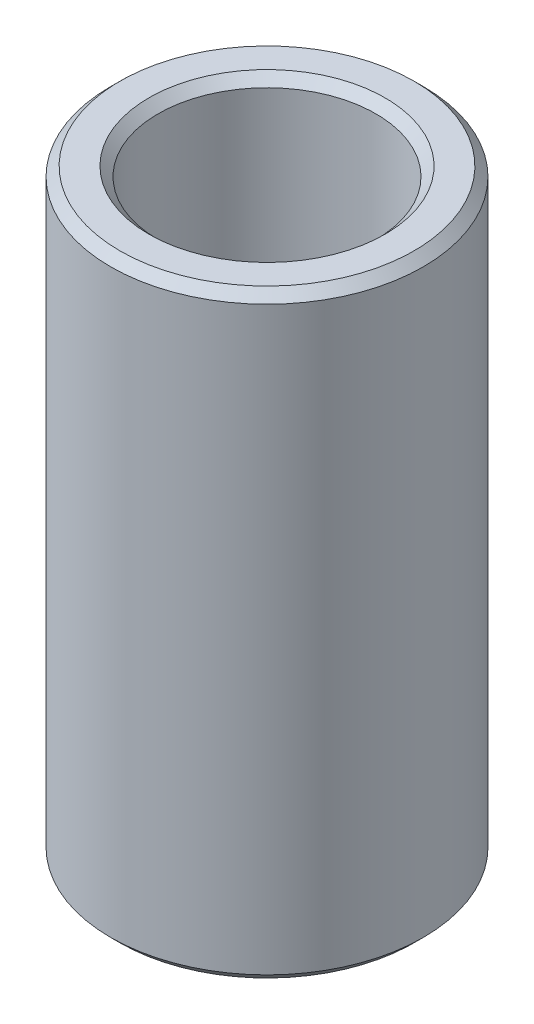
ISO-10303-21;
HEADER;
FILE_DESCRIPTION(('STEP AP214'),'2;1');
FILE_NAME('part.step','',(''),(''),'','','');
FILE_SCHEMA(('AUTOMOTIVE_DESIGN { 1 0 10303 214 1 1 1 1 }'));
ENDSEC;
DATA;
#1=APPLICATION_CONTEXT('core data for automotive mechanical design processes');
#2=APPLICATION_PROTOCOL_DEFINITION('international standard','automotive_design',2000,#1);
#3=PRODUCT_CONTEXT('',#1,'mechanical');
#4=PRODUCT('Part','Part','',(#3));
#5=PRODUCT_RELATED_PRODUCT_CATEGORY('part','',(#4));
#6=PRODUCT_DEFINITION_FORMATION('','',#4);
#7=PRODUCT_DEFINITION_CONTEXT('part definition',#1,'design');
#8=PRODUCT_DEFINITION('design','',#6,#7);
#9=PRODUCT_DEFINITION_SHAPE('','',#8);
#10=(LENGTH_UNIT() NAMED_UNIT(*) SI_UNIT(.MILLI.,.METRE.));
#11=(NAMED_UNIT(*) PLANE_ANGLE_UNIT() SI_UNIT($,.RADIAN.));
#12=(NAMED_UNIT(*) SI_UNIT($,.STERADIAN.) SOLID_ANGLE_UNIT());
#13=UNCERTAINTY_MEASURE_WITH_UNIT(LENGTH_MEASURE(1.E-05),#10,'distance_accuracy_value','');
#14=(GEOMETRIC_REPRESENTATION_CONTEXT(3) GLOBAL_UNCERTAINTY_ASSIGNED_CONTEXT((#13)) GLOBAL_UNIT_ASSIGNED_CONTEXT((#10,
#11,#12)) REPRESENTATION_CONTEXT('',''));
#15=CARTESIAN_POINT('',(0.,0.,0.));
#16=DIRECTION('',(0.,0.,1.));
#17=DIRECTION('',(1.,0.,0.));
#18=AXIS2_PLACEMENT_3D('',#15,#16,#17);
#19=CARTESIAN_POINT('',(0.,143.820953489908,0.));
#20=DIRECTION('',(0.,-1.,0.));
#21=DIRECTION('',(0.,0.,-1.));
#22=AXIS2_PLACEMENT_3D('',#19,#20,#21);
#23=CYLINDRICAL_SURFACE('',#22,37.5);
#24=CARTESIAN_POINT('',(0.,2.21261953764559,0.));
#25=DIRECTION('',(0.,1.,0.));
#26=DIRECTION('',(0.,0.,1.));
#27=AXIS2_PLACEMENT_3D('',#24,#25,#26);
#28=CIRCLE('',#27,37.5);
#29=CARTESIAN_POINT('',(0.,2.21261953764559,37.5));
#30=VERTEX_POINT('',#29);
#31=EDGE_CURVE('E10',#30,#30,#28,.T.);
#32=ORIENTED_EDGE('',*,*,#31,.T.);
#33=EDGE_LOOP('',(#32));
#34=FACE_BOUND('',#33,.T.);
#35=CARTESIAN_POINT('',(0.,141.608333952263,0.));
#36=DIRECTION('',(0.,1.,0.));
#37=DIRECTION('',(0.,0.,1.));
#38=AXIS2_PLACEMENT_3D('',#35,#36,#37);
#39=CIRCLE('',#38,37.5);
#40=CARTESIAN_POINT('',(0.,141.608333952263,37.5));
#41=VERTEX_POINT('',#40);
#42=EDGE_CURVE('E50',#41,#41,#39,.F.);
#43=ORIENTED_EDGE('',*,*,#42,.T.);
#44=EDGE_LOOP('',(#43));
#45=FACE_BOUND('',#44,.T.);
#46=ADVANCED_FACE('F39',(#34,#45),#23,.T.);
#47=CARTESIAN_POINT('',(0.,143.820953489908,0.));
#48=DIRECTION('',(0.,1.,0.));
#49=DIRECTION('',(0.,0.,1.));
#50=AXIS2_PLACEMENT_3D('',#47,#48,#49);
#51=PLANE('',#50);
#52=CARTESIAN_POINT('',(0.,143.820953489908,0.));
#53=DIRECTION('',(0.,1.,0.));
#54=DIRECTION('',(0.,0.,1.));
#55=AXIS2_PLACEMENT_3D('',#52,#53,#54);
#56=CIRCLE('',#55,28.3546320281943);
#57=CARTESIAN_POINT('',(0.,143.820953489908,28.3546320281943));
#58=VERTEX_POINT('',#57);
#59=EDGE_CURVE('E58',#58,#58,#56,.F.);
#60=ORIENTED_EDGE('',*,*,#59,.T.);
#61=EDGE_LOOP('',(#60));
#62=FACE_BOUND('',#61,.T.);
#63=CARTESIAN_POINT('',(0.,143.820953489908,0.));
#64=DIRECTION('',(0.,1.,0.));
#65=DIRECTION('',(0.,0.,1.));
#66=AXIS2_PLACEMENT_3D('',#63,#64,#65);
#67=CIRCLE('',#66,35.2873804623543);
#68=CARTESIAN_POINT('',(0.,143.820953489908,35.2873804623543));
#69=VERTEX_POINT('',#68);
#70=EDGE_CURVE('E61',#69,#69,#67,.T.);
#71=ORIENTED_EDGE('',*,*,#70,.T.);
#72=EDGE_LOOP('',(#71));
#73=FACE_BOUND('',#72,.T.);
#74=ADVANCED_FACE('F88',(#62,#73),#51,.T.);
#75=CARTESIAN_POINT('',(0.,0.,0.));
#76=DIRECTION('',(0.,1.,0.));
#77=DIRECTION('',(0.,0.,1.));
#78=AXIS2_PLACEMENT_3D('',#75,#76,#77);
#79=PLANE('',#78);
#80=CARTESIAN_POINT('',(0.,0.,0.));
#81=DIRECTION('',(0.,1.,0.));
#82=DIRECTION('',(0.,0.,1.));
#83=AXIS2_PLACEMENT_3D('',#80,#81,#82);
#84=CIRCLE('',#83,28.3546320281944);
#85=CARTESIAN_POINT('',(0.,0.,28.3546320281944));
#86=VERTEX_POINT('',#85);
#87=EDGE_CURVE('E51',#86,#86,#84,.T.);
#88=ORIENTED_EDGE('',*,*,#87,.T.);
#89=EDGE_LOOP('',(#88));
#90=FACE_BOUND('',#89,.T.);
#91=CARTESIAN_POINT('',(0.,0.,0.));
#92=DIRECTION('',(0.,1.,0.));
#93=DIRECTION('',(0.,0.,1.));
#94=AXIS2_PLACEMENT_3D('',#91,#92,#93);
#95=CIRCLE('',#94,35.2873804623544);
#96=CARTESIAN_POINT('',(0.,0.,35.2873804623544));
#97=VERTEX_POINT('',#96);
#98=EDGE_CURVE('E54',#97,#97,#95,.F.);
#99=ORIENTED_EDGE('',*,*,#98,.T.);
#100=EDGE_LOOP('',(#99));
#101=FACE_BOUND('',#100,.T.);
#102=ADVANCED_FACE('F83',(#90,#101),#79,.F.);
#103=CARTESIAN_POINT('',(0.,143.820953489908,0.));
#104=DIRECTION('',(0.,-1.,0.));
#105=DIRECTION('',(0.,0.,-1.));
#106=AXIS2_PLACEMENT_3D('',#103,#104,#105);
#107=CYLINDRICAL_SURFACE('',#106,26.1420124905487);
#108=CARTESIAN_POINT('',(0.,141.608333952263,0.));
#109=DIRECTION('',(0.,1.,0.));
#110=DIRECTION('',(0.,0.,1.));
#111=AXIS2_PLACEMENT_3D('',#108,#109,#110);
#112=CIRCLE('',#111,26.1420124905487);
#113=CARTESIAN_POINT('',(0.,141.608333952263,26.1420124905487));
#114=VERTEX_POINT('',#113);
#115=EDGE_CURVE('E67',#114,#114,#112,.T.);
#116=ORIENTED_EDGE('',*,*,#115,.T.);
#117=EDGE_LOOP('',(#116));
#118=FACE_BOUND('',#117,.T.);
#119=CARTESIAN_POINT('',(0.,2.21261953764568,0.));
#120=DIRECTION('',(0.,1.,0.));
#121=DIRECTION('',(0.,0.,1.));
#122=AXIS2_PLACEMENT_3D('',#119,#120,#121);
#123=CIRCLE('',#122,26.1420124905487);
#124=CARTESIAN_POINT('',(0.,2.21261953764568,26.1420124905487));
#125=VERTEX_POINT('',#124);
#126=EDGE_CURVE('E69',#125,#125,#123,.F.);
#127=ORIENTED_EDGE('',*,*,#126,.T.);
#128=EDGE_LOOP('',(#127));
#129=FACE_BOUND('',#128,.T.);
#130=ADVANCED_FACE('F71',(#118,#129),#107,.F.);
#131=CARTESIAN_POINT('',(0.,141.608333952263,0.));
#132=DIRECTION('',(0.,1.,0.));
#133=DIRECTION('',(0.,0.,1.));
#134=AXIS2_PLACEMENT_3D('',#131,#132,#133);
#135=CONICAL_SURFACE('',#134,26.1420124905487,0.785398163397447);
#136=ORIENTED_EDGE('',*,*,#59,.F.);
#137=EDGE_LOOP('',(#136));
#138=FACE_BOUND('',#137,.T.);
#139=ORIENTED_EDGE('',*,*,#115,.F.);
#140=EDGE_LOOP('',(#139));
#141=FACE_BOUND('',#140,.T.);
#142=ADVANCED_FACE('F77',(#138,#141),#135,.F.);
#143=CARTESIAN_POINT('',(0.,0.,0.));
#144=DIRECTION('',(0.,-1.,0.));
#145=DIRECTION('',(0.,0.,-1.));
#146=AXIS2_PLACEMENT_3D('',#143,#144,#145);
#147=CONICAL_SURFACE('',#146,28.3546320281944,0.785398163397443);
#148=ORIENTED_EDGE('',*,*,#126,.F.);
#149=EDGE_LOOP('',(#148));
#150=FACE_BOUND('',#149,.T.);
#151=ORIENTED_EDGE('',*,*,#87,.F.);
#152=EDGE_LOOP('',(#151));
#153=FACE_BOUND('',#152,.T.);
#154=ADVANCED_FACE('F73',(#150,#153),#147,.F.);
#155=CARTESIAN_POINT('',(0.,2.21261953764559,0.));
#156=DIRECTION('',(0.,1.,0.));
#157=DIRECTION('',(0.,0.,1.));
#158=AXIS2_PLACEMENT_3D('',#155,#156,#157);
#159=CONICAL_SURFACE('',#158,37.5,0.785398163397445);
#160=ORIENTED_EDGE('',*,*,#98,.F.);
#161=EDGE_LOOP('',(#160));
#162=FACE_BOUND('',#161,.T.);
#163=ORIENTED_EDGE('',*,*,#31,.F.);
#164=EDGE_LOOP('',(#163));
#165=FACE_BOUND('',#164,.T.);
#166=ADVANCED_FACE('F76',(#162,#165),#159,.T.);
#167=CARTESIAN_POINT('',(0.,143.820953489908,0.));
#168=DIRECTION('',(0.,-1.,0.));
#169=DIRECTION('',(0.,0.,-1.));
#170=AXIS2_PLACEMENT_3D('',#167,#168,#169);
#171=CONICAL_SURFACE('',#170,35.2873804623543,0.785398163397442);
#172=ORIENTED_EDGE('',*,*,#42,.F.);
#173=EDGE_LOOP('',(#172));
#174=FACE_BOUND('',#173,.T.);
#175=ORIENTED_EDGE('',*,*,#70,.F.);
#176=EDGE_LOOP('',(#175));
#177=FACE_BOUND('',#176,.T.);
#178=ADVANCED_FACE('F45',(#174,#177),#171,.T.);
#179=CLOSED_SHELL('',(#46,#74,#102,#130,#142,#154,#166,#178));
#180=MANIFOLD_SOLID_BREP('B2',#179);
#181=ADVANCED_BREP_SHAPE_REPRESENTATION('',(#18,#180),#14);
#182=SHAPE_DEFINITION_REPRESENTATION(#9,#181);
ENDSEC;
END-ISO-10303-21;
